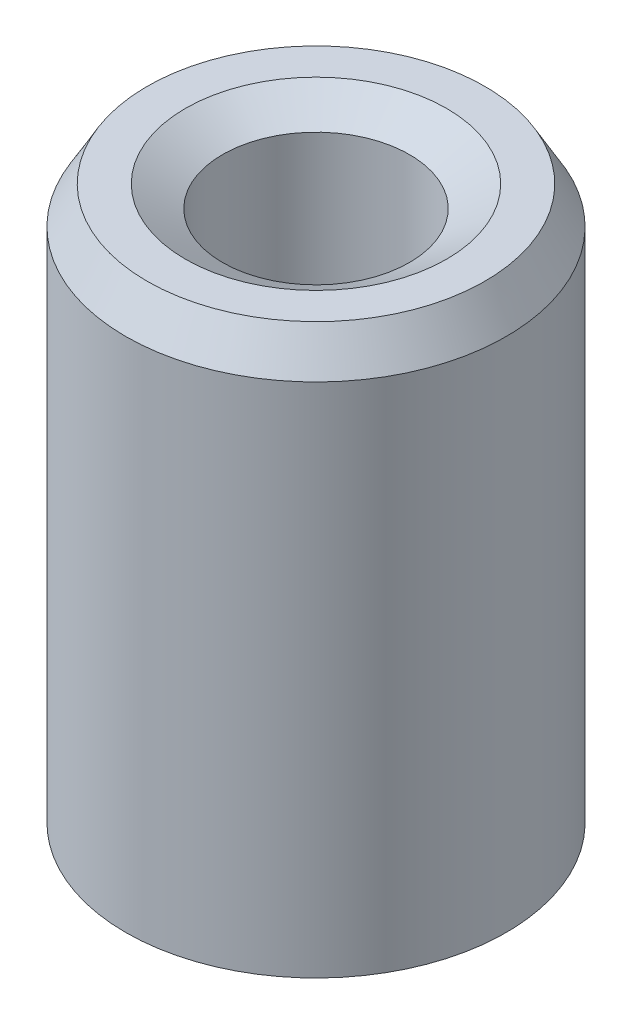
ISO-10303-21;
HEADER;
FILE_DESCRIPTION(('STEP AP214'),'2;1');
FILE_NAME('part.step','',(''),(''),'','','');
FILE_SCHEMA(('AUTOMOTIVE_DESIGN { 1 0 10303 214 1 1 1 1 }'));
ENDSEC;
DATA;
#1=APPLICATION_CONTEXT('core data for automotive mechanical design processes');
#2=APPLICATION_PROTOCOL_DEFINITION('international standard','automotive_design',2000,#1);
#3=PRODUCT_CONTEXT('',#1,'mechanical');
#4=PRODUCT('Part','Part','',(#3));
#5=PRODUCT_RELATED_PRODUCT_CATEGORY('part','',(#4));
#6=PRODUCT_DEFINITION_FORMATION('','',#4);
#7=PRODUCT_DEFINITION_CONTEXT('part definition',#1,'design');
#8=PRODUCT_DEFINITION('design','',#6,#7);
#9=PRODUCT_DEFINITION_SHAPE('','',#8);
#10=(LENGTH_UNIT() NAMED_UNIT(*) SI_UNIT(.MILLI.,.METRE.));
#11=(NAMED_UNIT(*) PLANE_ANGLE_UNIT() SI_UNIT($,.RADIAN.));
#12=(NAMED_UNIT(*) SI_UNIT($,.STERADIAN.) SOLID_ANGLE_UNIT());
#13=UNCERTAINTY_MEASURE_WITH_UNIT(LENGTH_MEASURE(1.E-05),#10,'distance_accuracy_value','');
#14=(GEOMETRIC_REPRESENTATION_CONTEXT(3) GLOBAL_UNCERTAINTY_ASSIGNED_CONTEXT((#13)) GLOBAL_UNIT_ASSIGNED_CONTEXT((#10,
#11,#12)) REPRESENTATION_CONTEXT('',''));
#15=CARTESIAN_POINT('',(0.,0.,0.));
#16=DIRECTION('',(0.,0.,1.));
#17=DIRECTION('',(1.,0.,0.));
#18=AXIS2_PLACEMENT_3D('',#15,#16,#17);
#19=CARTESIAN_POINT('',(0.,15.1020276649496,0.));
#20=DIRECTION('',(0.,-1.,0.));
#21=DIRECTION('',(0.,0.,-1.));
#22=AXIS2_PLACEMENT_3D('',#19,#20,#21);
#23=CYLINDRICAL_SURFACE('',#22,5.);
#24=CARTESIAN_POINT('',(0.,0.56288415899184,0.));
#25=DIRECTION('',(0.,1.,0.));
#26=DIRECTION('',(0.,0.,1.));
#27=AXIS2_PLACEMENT_3D('',#24,#25,#26);
#28=CIRCLE('',#27,5.);
#29=CARTESIAN_POINT('',(0.,0.56288415899184,5.));
#30=VERTEX_POINT('',#29);
#31=EDGE_CURVE('E10',#30,#30,#28,.T.);
#32=ORIENTED_EDGE('',*,*,#31,.T.);
#33=EDGE_LOOP('',(#32));
#34=FACE_BOUND('',#33,.T.);
#35=CARTESIAN_POINT('',(0.,14.1270837028001,0.));
#36=DIRECTION('',(0.,1.,0.));
#37=DIRECTION('',(0.,0.,1.));
#38=AXIS2_PLACEMENT_3D('',#35,#36,#37);
#39=CIRCLE('',#38,5.);
#40=CARTESIAN_POINT('',(0.,14.1270837028001,5.));
#41=VERTEX_POINT('',#40);
#42=EDGE_CURVE('E50',#41,#41,#39,.F.);
#43=ORIENTED_EDGE('',*,*,#42,.T.);
#44=EDGE_LOOP('',(#43));
#45=FACE_BOUND('',#44,.T.);
#46=ADVANCED_FACE('F39',(#34,#45),#23,.T.);
#47=CARTESIAN_POINT('',(0.,15.1020276649496,0.));
#48=DIRECTION('',(0.,1.,0.));
#49=DIRECTION('',(0.,0.,1.));
#50=AXIS2_PLACEMENT_3D('',#47,#48,#49);
#51=PLANE('',#50);
#52=CARTESIAN_POINT('',(0.,15.1020276649496,0.));
#53=DIRECTION('',(0.,1.,0.));
#54=DIRECTION('',(0.,0.,1.));
#55=AXIS2_PLACEMENT_3D('',#52,#53,#54);
#56=CIRCLE('',#55,3.43261148987717);
#57=CARTESIAN_POINT('',(0.,15.1020276649496,3.43261148987717));
#58=VERTEX_POINT('',#57);
#59=EDGE_CURVE('E58',#58,#58,#56,.F.);
#60=ORIENTED_EDGE('',*,*,#59,.T.);
#61=EDGE_LOOP('',(#60));
#62=FACE_BOUND('',#61,.T.);
#63=CARTESIAN_POINT('',(0.,15.1020276649496,0.));
#64=DIRECTION('',(0.,1.,0.));
#65=DIRECTION('',(0.,0.,1.));
#66=AXIS2_PLACEMENT_3D('',#63,#64,#65);
#67=CIRCLE('',#66,4.43711584100816);
#68=CARTESIAN_POINT('',(0.,15.1020276649496,4.43711584100816));
#69=VERTEX_POINT('',#68);
#70=EDGE_CURVE('E61',#69,#69,#67,.T.);
#71=ORIENTED_EDGE('',*,*,#70,.T.);
#72=EDGE_LOOP('',(#71));
#73=FACE_BOUND('',#72,.T.);
#74=ADVANCED_FACE('F88',(#62,#73),#51,.T.);
#75=CARTESIAN_POINT('',(0.,0.,0.));
#76=DIRECTION('',(0.,1.,0.));
#77=DIRECTION('',(0.,0.,1.));
#78=AXIS2_PLACEMENT_3D('',#75,#76,#77);
#79=PLANE('',#78);
#80=CARTESIAN_POINT('',(0.,0.,0.));
#81=DIRECTION('',(0.,1.,0.));
#82=DIRECTION('',(0.,0.,1.));
#83=AXIS2_PLACEMENT_3D('',#80,#81,#82);
#84=CIRCLE('',#83,3.02055168671947);
#85=CARTESIAN_POINT('',(0.,0.,3.02055168671947));
#86=VERTEX_POINT('',#85);
#87=EDGE_CURVE('E51',#86,#86,#84,.T.);
#88=ORIENTED_EDGE('',*,*,#87,.T.);
#89=EDGE_LOOP('',(#88));
#90=FACE_BOUND('',#89,.T.);
#91=CARTESIAN_POINT('',(0.,0.,0.));
#92=DIRECTION('',(0.,1.,0.));
#93=DIRECTION('',(0.,0.,1.));
#94=AXIS2_PLACEMENT_3D('',#91,#92,#93);
#95=CIRCLE('',#94,4.02505603785045);
#96=CARTESIAN_POINT('',(0.,0.,4.02505603785045));
#97=VERTEX_POINT('',#96);
#98=EDGE_CURVE('E54',#97,#97,#95,.F.);
#99=ORIENTED_EDGE('',*,*,#98,.T.);
#100=EDGE_LOOP('',(#99));
#101=FACE_BOUND('',#100,.T.);
#102=ADVANCED_FACE('F83',(#90,#101),#79,.F.);
#103=CARTESIAN_POINT('',(0.,15.1020276649496,0.));
#104=DIRECTION('',(0.,-1.,0.));
#105=DIRECTION('',(0.,0.,-1.));
#106=AXIS2_PLACEMENT_3D('',#103,#104,#105);
#107=CYLINDRICAL_SURFACE('',#106,2.45766752772763);
#108=CARTESIAN_POINT('',(0.,14.5391435059578,0.));
#109=DIRECTION('',(0.,1.,0.));
#110=DIRECTION('',(0.,0.,1.));
#111=AXIS2_PLACEMENT_3D('',#108,#109,#110);
#112=CIRCLE('',#111,2.45766752772763);
#113=CARTESIAN_POINT('',(0.,14.5391435059578,2.45766752772763));
#114=VERTEX_POINT('',#113);
#115=EDGE_CURVE('E67',#114,#114,#112,.T.);
#116=ORIENTED_EDGE('',*,*,#115,.T.);
#117=EDGE_LOOP('',(#116));
#118=FACE_BOUND('',#117,.T.);
#119=CARTESIAN_POINT('',(0.,0.974943962149552,0.));
#120=DIRECTION('',(0.,1.,0.));
#121=DIRECTION('',(0.,0.,1.));
#122=AXIS2_PLACEMENT_3D('',#119,#120,#121);
#123=CIRCLE('',#122,2.45766752772763);
#124=CARTESIAN_POINT('',(0.,0.974943962149552,2.45766752772763));
#125=VERTEX_POINT('',#124);
#126=EDGE_CURVE('E69',#125,#125,#123,.F.);
#127=ORIENTED_EDGE('',*,*,#126,.T.);
#128=EDGE_LOOP('',(#127));
#129=FACE_BOUND('',#128,.T.);
#130=ADVANCED_FACE('F71',(#118,#129),#107,.F.);
#131=CARTESIAN_POINT('',(0.,14.5391435059578,0.));
#132=DIRECTION('',(0.,1.,0.));
#133=DIRECTION('',(0.,0.,1.));
#134=AXIS2_PLACEMENT_3D('',#131,#132,#133);
#135=CONICAL_SURFACE('',#134,2.45766752772763,1.0471975511966);
#136=ORIENTED_EDGE('',*,*,#59,.F.);
#137=EDGE_LOOP('',(#136));
#138=FACE_BOUND('',#137,.T.);
#139=ORIENTED_EDGE('',*,*,#115,.F.);
#140=EDGE_LOOP('',(#139));
#141=FACE_BOUND('',#140,.T.);
#142=ADVANCED_FACE('F77',(#138,#141),#135,.F.);
#143=CARTESIAN_POINT('',(0.,0.,0.));
#144=DIRECTION('',(0.,-1.,0.));
#145=DIRECTION('',(0.,0.,-1.));
#146=AXIS2_PLACEMENT_3D('',#143,#144,#145);
#147=CONICAL_SURFACE('',#146,3.02055168671947,0.523598775598296);
#148=ORIENTED_EDGE('',*,*,#126,.F.);
#149=EDGE_LOOP('',(#148));
#150=FACE_BOUND('',#149,.T.);
#151=ORIENTED_EDGE('',*,*,#87,.F.);
#152=EDGE_LOOP('',(#151));
#153=FACE_BOUND('',#152,.T.);
#154=ADVANCED_FACE('F73',(#150,#153),#147,.F.);
#155=CARTESIAN_POINT('',(0.,0.56288415899184,0.));
#156=DIRECTION('',(0.,1.,0.));
#157=DIRECTION('',(0.,0.,1.));
#158=AXIS2_PLACEMENT_3D('',#155,#156,#157);
#159=CONICAL_SURFACE('',#158,5.,1.0471975511966);
#160=ORIENTED_EDGE('',*,*,#98,.F.);
#161=EDGE_LOOP('',(#160));
#162=FACE_BOUND('',#161,.T.);
#163=ORIENTED_EDGE('',*,*,#31,.F.);
#164=EDGE_LOOP('',(#163));
#165=FACE_BOUND('',#164,.T.);
#166=ADVANCED_FACE('F76',(#162,#165),#159,.T.);
#167=CARTESIAN_POINT('',(0.,15.1020276649496,0.));
#168=DIRECTION('',(0.,-1.,0.));
#169=DIRECTION('',(0.,0.,-1.));
#170=AXIS2_PLACEMENT_3D('',#167,#168,#169);
#171=CONICAL_SURFACE('',#170,4.43711584100816,0.523598775598295);
#172=ORIENTED_EDGE('',*,*,#42,.F.);
#173=EDGE_LOOP('',(#172));
#174=FACE_BOUND('',#173,.T.);
#175=ORIENTED_EDGE('',*,*,#70,.F.);
#176=EDGE_LOOP('',(#175));
#177=FACE_BOUND('',#176,.T.);
#178=ADVANCED_FACE('F45',(#174,#177),#171,.T.);
#179=CLOSED_SHELL('',(#46,#74,#102,#130,#142,#154,#166,#178));
#180=MANIFOLD_SOLID_BREP('B2',#179);
#181=ADVANCED_BREP_SHAPE_REPRESENTATION('',(#18,#180),#14);
#182=SHAPE_DEFINITION_REPRESENTATION(#9,#181);
ENDSEC;
END-ISO-10303-21;
